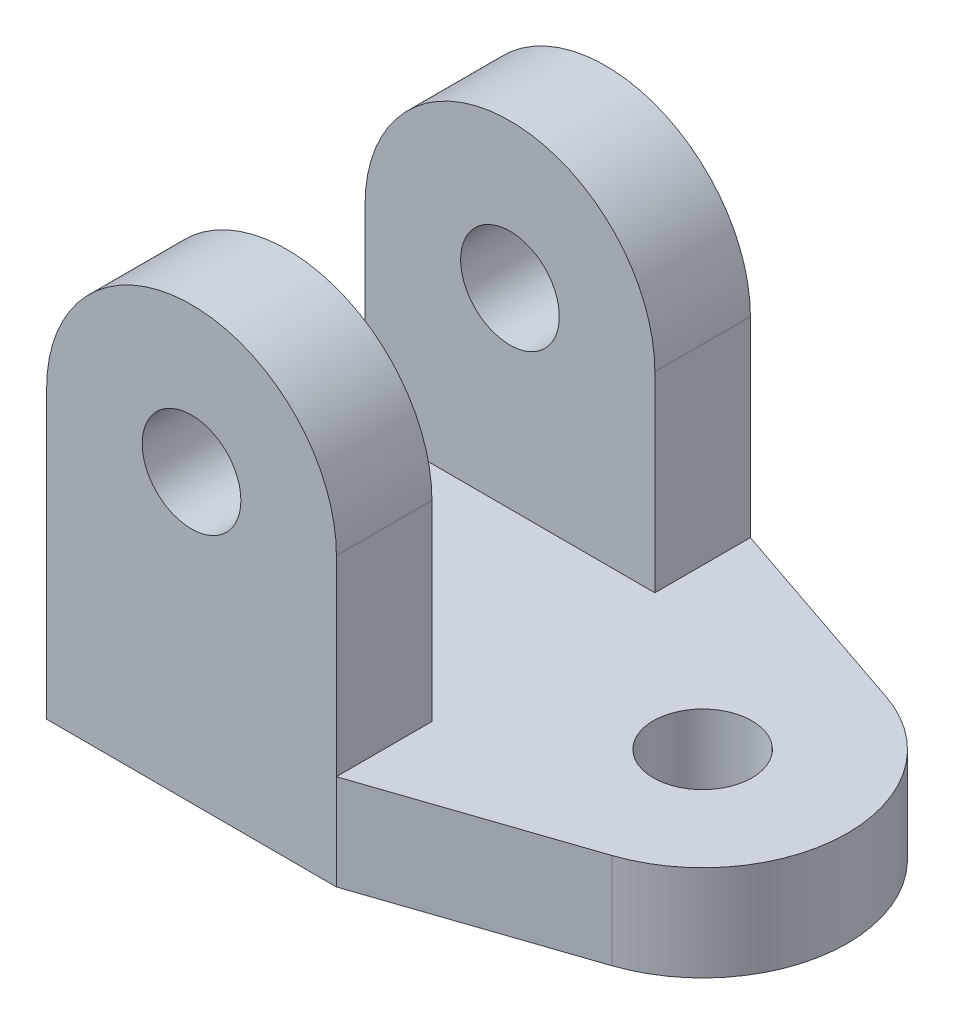
ISO-10303-21;
HEADER;
FILE_DESCRIPTION(('STEP AP214'),'2;1');
FILE_NAME('part.step','',(''),(''),'','','');
FILE_SCHEMA(('AUTOMOTIVE_DESIGN { 1 0 10303 214 1 1 1 1 }'));
ENDSEC;
DATA;
#1=APPLICATION_CONTEXT('core data for automotive mechanical design processes');
#2=APPLICATION_PROTOCOL_DEFINITION('international standard','automotive_design',2000,#1);
#3=PRODUCT_CONTEXT('',#1,'mechanical');
#4=PRODUCT('Part','Part','',(#3));
#5=PRODUCT_RELATED_PRODUCT_CATEGORY('part','',(#4));
#6=PRODUCT_DEFINITION_FORMATION('','',#4);
#7=PRODUCT_DEFINITION_CONTEXT('part definition',#1,'design');
#8=PRODUCT_DEFINITION('design','',#6,#7);
#9=PRODUCT_DEFINITION_SHAPE('','',#8);
#10=(LENGTH_UNIT() NAMED_UNIT(*) SI_UNIT(.MILLI.,.METRE.));
#11=(NAMED_UNIT(*) PLANE_ANGLE_UNIT() SI_UNIT($,.RADIAN.));
#12=(NAMED_UNIT(*) SI_UNIT($,.STERADIAN.) SOLID_ANGLE_UNIT());
#13=UNCERTAINTY_MEASURE_WITH_UNIT(LENGTH_MEASURE(1.E-05),#10,'distance_accuracy_value','');
#14=(GEOMETRIC_REPRESENTATION_CONTEXT(3) GLOBAL_UNCERTAINTY_ASSIGNED_CONTEXT((#13)) GLOBAL_UNIT_ASSIGNED_CONTEXT((#10,
#11,#12)) REPRESENTATION_CONTEXT('',''));
#15=CARTESIAN_POINT('',(0.,0.,0.));
#16=DIRECTION('',(0.,0.,1.));
#17=DIRECTION('',(1.,0.,0.));
#18=AXIS2_PLACEMENT_3D('',#15,#16,#17);
#19=CARTESIAN_POINT('',(-0.0141145084440973,-10.8957658007297,0.));
#20=DIRECTION('',(-0.00129541115874928,-0.999999160954613,0.));
#21=DIRECTION('',(0.999999160954613,-0.00129541115874928,0.));
#22=AXIS2_PLACEMENT_3D('',#19,#20,#21);
#23=PLANE('',#22);
#24=CARTESIAN_POINT('',(94.5499958047985,-11.0182653072293,-3.5));
#25=DIRECTION('',(-0.00129541115874928,-0.999999160954613,0.));
#26=DIRECTION('',(0.999999160954613,-0.00129541115874928,0.));
#27=AXIS2_PLACEMENT_3D('',#24,#25,#26);
#28=CIRCLE('',#27,1.54999999999999);
#29=CARTESIAN_POINT('',(96.0999945042781,-11.0202731945254,-3.5));
#30=VERTEX_POINT('',#29);
#31=EDGE_CURVE('E164',#30,#30,#28,.T.);
#32=ORIENTED_EDGE('',*,*,#31,.T.);
#33=EDGE_LOOP('',(#32));
#34=FACE_BOUND('',#33,.T.);
#35=DIRECTION('',(-0.999999160954613,0.00129541115874926,0.));
#36=VECTOR('',#35,1.);
#37=CARTESIAN_POINT('',(89.5500000000254,-11.0117882514356,-7.));
#38=LINE('',#37,#36);
#39=CARTESIAN_POINT('',(89.5500000000254,-11.0117882514356,-7.));
#40=VERTEX_POINT('',#39);
#41=CARTESIAN_POINT('',(80.4499999999746,-11.,-7.));
#42=VERTEX_POINT('',#41);
#43=EDGE_CURVE('E57',#40,#42,#38,.T.);
#44=ORIENTED_EDGE('',*,*,#43,.T.);
#45=DIRECTION('',(0.,0.,-1.));
#46=VECTOR('',#45,1.);
#47=CARTESIAN_POINT('',(80.4499999999746,-11.,0.));
#48=LINE('',#47,#46);
#49=CARTESIAN_POINT('',(80.4499999999746,-11.,0.));
#50=VERTEX_POINT('',#49);
#51=EDGE_CURVE('E183',#50,#42,#48,.T.);
#52=ORIENTED_EDGE('',*,*,#51,.F.);
#53=DIRECTION('',(-0.999999160954613,0.00129541115874926,0.));
#54=VECTOR('',#53,1.);
#55=CARTESIAN_POINT('',(-0.014114508444097,-10.8957658007297,0.));
#56=LINE('',#55,#54);
#57=CARTESIAN_POINT('',(89.5500000000254,-11.0117882514356,0.));
#58=VERTEX_POINT('',#57);
#59=EDGE_CURVE('E38',#58,#50,#56,.T.);
#60=ORIENTED_EDGE('',*,*,#59,.F.);
#61=DIRECTION('',(0.,0.,-1.));
#62=VECTOR('',#61,1.);
#63=CARTESIAN_POINT('',(89.5500000000254,-11.0117882514356,3.));
#64=LINE('',#63,#62);
#65=CARTESIAN_POINT('',(89.5500000000254,-11.0117882514356,3.));
#66=VERTEX_POINT('',#65);
#67=EDGE_CURVE('E11',#66,#58,#64,.T.);
#68=ORIENTED_EDGE('',*,*,#67,.F.);
#69=DIRECTION('',(0.947030642459823,-0.00122679509125672,-0.321140868180835));
#70=VECTOR('',#69,1.);
#71=CARTESIAN_POINT('',(10.1351538632099,-10.9089132872628,29.9298072220575));
#72=LINE('',#71,#70);
#73=CARTESIAN_POINT('',(96.0111855290157,-11.0201581502913,0.808993038632917));
#74=VERTEX_POINT('',#73);
#75=EDGE_CURVE('E180',#66,#74,#72,.T.);
#76=ORIENTED_EDGE('',*,*,#75,.T.);
#77=CARTESIAN_POINT('',(94.5499958047985,-11.0182653072293,-3.5));
#78=DIRECTION('',(-0.00129541115874928,-0.999999160954613,0.));
#79=DIRECTION('',(0.999999160954613,-0.00129541115874928,0.));
#80=AXIS2_PLACEMENT_3D('',#77,#78,#79);
#81=CIRCLE('',#80,4.54999999999999);
#82=CARTESIAN_POINT('',(96.0111855290157,-11.0201581502913,-7.80899303863292));
#83=VERTEX_POINT('',#82);
#84=EDGE_CURVE('E155',#83,#74,#81,.T.);
#85=ORIENTED_EDGE('',*,*,#84,.F.);
#86=DIRECTION('',(0.947030642459822,-0.00122679509125672,0.321140868180836));
#87=VECTOR('',#86,1.);
#88=CARTESIAN_POINT('',(12.2640655622038,-10.9116711055476,-36.2078870215461));
#89=LINE('',#88,#87);
#90=CARTESIAN_POINT('',(89.5500000000254,-11.0117882514356,-10.));
#91=VERTEX_POINT('',#90);
#92=EDGE_CURVE('E153',#91,#83,#89,.T.);
#93=ORIENTED_EDGE('',*,*,#92,.F.);
#94=DIRECTION('',(0.,0.,1.));
#95=VECTOR('',#94,1.);
#96=CARTESIAN_POINT('',(89.5500000000254,-11.0117882514356,-10.));
#97=LINE('',#96,#95);
#98=EDGE_CURVE('E52',#91,#40,#97,.T.);
#99=ORIENTED_EDGE('',*,*,#98,.T.);
#100=EDGE_LOOP('',(#44,#52,#60,#68,#76,#85,#93,#99));
#101=FACE_BOUND('',#100,.T.);
#102=ADVANCED_FACE('F34',(#34,#101),#23,.F.);
#103=CARTESIAN_POINT('',(89.5500000000254,0.,3.));
#104=DIRECTION('',(1.,0.,0.));
#105=DIRECTION('',(0.,0.,-1.));
#106=AXIS2_PLACEMENT_3D('',#103,#104,#105);
#107=PLANE('',#106);
#108=DIRECTION('',(0.,-1.,0.));
#109=VECTOR('',#108,1.);
#110=CARTESIAN_POINT('',(89.5500000000254,0.,0.));
#111=LINE('',#110,#109);
#112=CARTESIAN_POINT('',(89.550000000009,-5.,0.));
#113=VERTEX_POINT('',#112);
#114=EDGE_CURVE('E206',#113,#58,#111,.T.);
#115=ORIENTED_EDGE('',*,*,#114,.F.);
#116=DIRECTION('',(0.,0.,-1.));
#117=VECTOR('',#116,1.);
#118=CARTESIAN_POINT('',(89.550000000009,-5.,3.));
#119=LINE('',#118,#117);
#120=CARTESIAN_POINT('',(89.550000000009,-5.,3.));
#121=VERTEX_POINT('',#120);
#122=EDGE_CURVE('E44',#121,#113,#119,.T.);
#123=ORIENTED_EDGE('',*,*,#122,.F.);
#124=DIRECTION('',(0.,-1.,0.));
#125=VECTOR('',#124,1.);
#126=CARTESIAN_POINT('',(89.5500000000254,0.,3.));
#127=LINE('',#126,#125);
#128=EDGE_CURVE('E192',#121,#66,#127,.T.);
#129=ORIENTED_EDGE('',*,*,#128,.T.);
#130=ORIENTED_EDGE('',*,*,#67,.T.);
#131=EDGE_LOOP('',(#115,#123,#129,#130));
#132=FACE_BOUND('',#131,.T.);
#133=ADVANCED_FACE('F36',(#132),#107,.T.);
#134=CARTESIAN_POINT('',(85.,-5.,3.));
#135=DIRECTION('',(0.,0.,-1.));
#136=DIRECTION('',(-1.,0.,0.));
#137=AXIS2_PLACEMENT_3D('',#134,#135,#136);
#138=CYLINDRICAL_SURFACE('',#137,4.5499999999926);
#139=CARTESIAN_POINT('',(85.,-5.,0.));
#140=DIRECTION('',(0.,0.,1.));
#141=DIRECTION('',(1.,0.,0.));
#142=AXIS2_PLACEMENT_3D('',#139,#140,#141);
#143=CIRCLE('',#142,4.5499999999926);
#144=CARTESIAN_POINT('',(80.449999999991,-5.00000000000001,0.));
#145=VERTEX_POINT('',#144);
#146=EDGE_CURVE('E209',#113,#145,#143,.T.);
#147=ORIENTED_EDGE('',*,*,#146,.T.);
#148=DIRECTION('',(0.,0.,-1.));
#149=VECTOR('',#148,1.);
#150=CARTESIAN_POINT('',(80.449999999991,-5.00000000000001,3.));
#151=LINE('',#150,#149);
#152=CARTESIAN_POINT('',(80.449999999991,-5.00000000000001,3.));
#153=VERTEX_POINT('',#152);
#154=EDGE_CURVE('E214',#153,#145,#151,.T.);
#155=ORIENTED_EDGE('',*,*,#154,.F.);
#156=CARTESIAN_POINT('',(85.,-5.,3.));
#157=DIRECTION('',(0.,0.,1.));
#158=DIRECTION('',(1.,0.,0.));
#159=AXIS2_PLACEMENT_3D('',#156,#157,#158);
#160=CIRCLE('',#159,4.5499999999926);
#161=EDGE_CURVE('E195',#121,#153,#160,.T.);
#162=ORIENTED_EDGE('',*,*,#161,.F.);
#163=ORIENTED_EDGE('',*,*,#122,.T.);
#164=EDGE_LOOP('',(#147,#155,#162,#163));
#165=FACE_BOUND('',#164,.T.);
#166=ADVANCED_FACE('F262',(#165),#138,.T.);
#167=CARTESIAN_POINT('',(80.4499999999746,0.,3.));
#168=DIRECTION('',(1.,0.,0.));
#169=DIRECTION('',(0.,0.,-1.));
#170=AXIS2_PLACEMENT_3D('',#167,#168,#169);
#171=PLANE('',#170);
#172=DIRECTION('',(0.,-1.,0.));
#173=VECTOR('',#172,1.);
#174=CARTESIAN_POINT('',(80.4499999999746,0.,0.));
#175=LINE('',#174,#173);
#176=EDGE_CURVE('E211',#145,#50,#175,.T.);
#177=ORIENTED_EDGE('',*,*,#176,.T.);
#178=DIRECTION('',(0.,0.,-1.));
#179=VECTOR('',#178,1.);
#180=CARTESIAN_POINT('',(80.4499999999746,-11.,3.));
#181=LINE('',#180,#179);
#182=CARTESIAN_POINT('',(80.4499999999746,-11.,3.));
#183=VERTEX_POINT('',#182);
#184=EDGE_CURVE('E203',#183,#50,#181,.T.);
#185=ORIENTED_EDGE('',*,*,#184,.F.);
#186=DIRECTION('',(0.,-1.,0.));
#187=VECTOR('',#186,1.);
#188=CARTESIAN_POINT('',(80.4499999999746,0.,3.));
#189=LINE('',#188,#187);
#190=EDGE_CURVE('E198',#153,#183,#189,.T.);
#191=ORIENTED_EDGE('',*,*,#190,.F.);
#192=ORIENTED_EDGE('',*,*,#154,.T.);
#193=EDGE_LOOP('',(#177,#185,#191,#192));
#194=FACE_BOUND('',#193,.T.);
#195=ADVANCED_FACE('F228',(#194),#171,.F.);
#196=CARTESIAN_POINT('',(85.,-5.,3.));
#197=DIRECTION('',(0.,0.,-1.));
#198=DIRECTION('',(-1.,0.,0.));
#199=AXIS2_PLACEMENT_3D('',#196,#197,#198);
#200=CYLINDRICAL_SURFACE('',#199,1.54999999999259);
#201=CARTESIAN_POINT('',(85.,-5.,3.));
#202=DIRECTION('',(0.,0.,1.));
#203=DIRECTION('',(1.,0.,0.));
#204=AXIS2_PLACEMENT_3D('',#201,#202,#203);
#205=CIRCLE('',#204,1.54999999999259);
#206=CARTESIAN_POINT('',(86.5499999999926,-5.,3.));
#207=VERTEX_POINT('',#206);
#208=EDGE_CURVE('E201',#207,#207,#205,.T.);
#209=ORIENTED_EDGE('',*,*,#208,.T.);
#210=EDGE_LOOP('',(#209));
#211=FACE_BOUND('',#210,.T.);
#212=CARTESIAN_POINT('',(85.,-5.,0.));
#213=DIRECTION('',(0.,0.,1.));
#214=DIRECTION('',(1.,0.,0.));
#215=AXIS2_PLACEMENT_3D('',#212,#213,#214);
#216=CIRCLE('',#215,1.54999999999259);
#217=CARTESIAN_POINT('',(86.5499999999926,-5.,0.));
#218=VERTEX_POINT('',#217);
#219=EDGE_CURVE('E196',#218,#218,#216,.T.);
#220=ORIENTED_EDGE('',*,*,#219,.F.);
#221=EDGE_LOOP('',(#220));
#222=FACE_BOUND('',#221,.T.);
#223=ADVANCED_FACE('F412',(#211,#222),#200,.F.);
#224=CARTESIAN_POINT('',(0.,0.,3.));
#225=DIRECTION('',(0.,0.,1.));
#226=DIRECTION('',(1.,0.,0.));
#227=AXIS2_PLACEMENT_3D('',#224,#225,#226);
#228=PLANE('',#227);
#229=ORIENTED_EDGE('',*,*,#190,.T.);
#230=DIRECTION('',(0.00129541115874926,0.999999160954613,0.));
#231=VECTOR('',#230,1.);
#232=CARTESIAN_POINT('',(80.4461137664984,-13.9999974828638,3.));
#233=LINE('',#232,#231);
#234=CARTESIAN_POINT('',(80.4461137664984,-13.9999974828638,3.));
#235=VERTEX_POINT('',#234);
#236=EDGE_CURVE('E250',#235,#183,#233,.T.);
#237=ORIENTED_EDGE('',*,*,#236,.F.);
#238=DIRECTION('',(-0.999999160954613,0.00129541115874928,0.));
#239=VECTOR('',#238,1.);
#240=CARTESIAN_POINT('',(-0.0180007419203451,-13.8957632835935,3.));
#241=LINE('',#240,#239);
#242=CARTESIAN_POINT('',(89.5461137665491,-14.0117857342994,3.));
#243=VERTEX_POINT('',#242);
#244=EDGE_CURVE('E171',#243,#235,#241,.T.);
#245=ORIENTED_EDGE('',*,*,#244,.F.);
#246=DIRECTION('',(0.00129541115874926,0.999999160954613,0.));
#247=VECTOR('',#246,1.);
#248=CARTESIAN_POINT('',(89.5461137665491,-14.0117857342994,3.));
#249=LINE('',#248,#247);
#250=EDGE_CURVE('E245',#243,#66,#249,.T.);
#251=ORIENTED_EDGE('',*,*,#250,.T.);
#252=ORIENTED_EDGE('',*,*,#128,.F.);
#253=ORIENTED_EDGE('',*,*,#161,.T.);
#254=EDGE_LOOP('',(#229,#237,#245,#251,#252,#253));
#255=FACE_BOUND('',#254,.T.);
#256=ORIENTED_EDGE('',*,*,#208,.F.);
#257=EDGE_LOOP('',(#256));
#258=FACE_BOUND('',#257,.T.);
#259=ADVANCED_FACE('F257',(#255,#258),#228,.T.);
#260=CARTESIAN_POINT('',(0.,0.,0.));
#261=DIRECTION('',(0.,0.,1.));
#262=DIRECTION('',(1.,0.,0.));
#263=AXIS2_PLACEMENT_3D('',#260,#261,#262);
#264=PLANE('',#263);
#265=ORIENTED_EDGE('',*,*,#59,.T.);
#266=ORIENTED_EDGE('',*,*,#176,.F.);
#267=ORIENTED_EDGE('',*,*,#146,.F.);
#268=ORIENTED_EDGE('',*,*,#114,.T.);
#269=EDGE_LOOP('',(#265,#266,#267,#268));
#270=FACE_BOUND('',#269,.T.);
#271=ORIENTED_EDGE('',*,*,#219,.T.);
#272=EDGE_LOOP('',(#271));
#273=FACE_BOUND('',#272,.T.);
#274=ADVANCED_FACE('F233',(#270,#273),#264,.F.);
#275=CARTESIAN_POINT('',(-0.0180007419203451,-13.8957632835935,-10.));
#276=DIRECTION('',(0.,0.,1.));
#277=DIRECTION('',(1.,0.,0.));
#278=AXIS2_PLACEMENT_3D('',#275,#276,#277);
#279=PLANE('',#278);
#280=DIRECTION('',(0.00129541115874926,0.999999160954613,0.));
#281=VECTOR('',#280,1.);
#282=CARTESIAN_POINT('',(80.4461137664984,-13.9999974828638,-10.));
#283=LINE('',#282,#281);
#284=CARTESIAN_POINT('',(80.4461137664984,-13.9999974828638,-10.));
#285=VERTEX_POINT('',#284);
#286=CARTESIAN_POINT('',(80.4499999999746,-11.,-10.));
#287=VERTEX_POINT('',#286);
#288=EDGE_CURVE('E146',#285,#287,#283,.T.);
#289=ORIENTED_EDGE('',*,*,#288,.T.);
#290=DIRECTION('',(2.73161123350481E-12,1.,0.));
#291=VECTOR('',#290,1.);
#292=CARTESIAN_POINT('',(80.4499999999746,-11.,-10.));
#293=LINE('',#292,#291);
#294=CARTESIAN_POINT('',(80.449999999991,-5.,-10.));
#295=VERTEX_POINT('',#294);
#296=EDGE_CURVE('E138',#287,#295,#293,.T.);
#297=ORIENTED_EDGE('',*,*,#296,.T.);
#298=CARTESIAN_POINT('',(85.,-5.,-10.));
#299=DIRECTION('',(0.,0.,-1.));
#300=DIRECTION('',(-1.,0.,0.));
#301=AXIS2_PLACEMENT_3D('',#298,#299,#300);
#302=CIRCLE('',#301,4.55000000000899);
#303=CARTESIAN_POINT('',(89.550000000009,-5.,-10.));
#304=VERTEX_POINT('',#303);
#305=EDGE_CURVE('E126',#295,#304,#302,.T.);
#306=ORIENTED_EDGE('',*,*,#305,.T.);
#307=DIRECTION('',(2.7262549370589E-12,-1.,0.));
#308=VECTOR('',#307,1.);
#309=CARTESIAN_POINT('',(89.550000000009,-5.,-10.));
#310=LINE('',#309,#308);
#311=EDGE_CURVE('E137',#304,#91,#310,.T.);
#312=ORIENTED_EDGE('',*,*,#311,.T.);
#313=DIRECTION('',(0.00129541115874926,0.999999160954613,0.));
#314=VECTOR('',#313,1.);
#315=CARTESIAN_POINT('',(89.5461137665491,-14.0117857342994,-10.));
#316=LINE('',#315,#314);
#317=CARTESIAN_POINT('',(89.5461137665491,-14.0117857342994,-10.));
#318=VERTEX_POINT('',#317);
#319=EDGE_CURVE('E190',#318,#91,#316,.T.);
#320=ORIENTED_EDGE('',*,*,#319,.F.);
#321=DIRECTION('',(0.999999160954613,-0.00129541115874928,0.));
#322=VECTOR('',#321,1.);
#323=CARTESIAN_POINT('',(-0.0180007419203451,-13.8957632835935,-10.));
#324=LINE('',#323,#322);
#325=EDGE_CURVE('E160',#285,#318,#324,.T.);
#326=ORIENTED_EDGE('',*,*,#325,.F.);
#327=EDGE_LOOP('',(#289,#297,#306,#312,#320,#326));
#328=FACE_BOUND('',#327,.T.);
#329=CARTESIAN_POINT('',(85.,-5.,-10.));
#330=DIRECTION('',(0.,0.,-1.));
#331=DIRECTION('',(-1.,0.,0.));
#332=AXIS2_PLACEMENT_3D('',#329,#330,#331);
#333=CIRCLE('',#332,1.55000000000001);
#334=CARTESIAN_POINT('',(83.45,-5.,-10.));
#335=VERTEX_POINT('',#334);
#336=EDGE_CURVE('E282',#335,#335,#333,.T.);
#337=ORIENTED_EDGE('',*,*,#336,.F.);
#338=EDGE_LOOP('',(#337));
#339=FACE_BOUND('',#338,.T.);
#340=ADVANCED_FACE('F142',(#328,#339),#279,.F.);
#341=CARTESIAN_POINT('',(12.2601793287276,-13.9116685884115,-36.2078870215461));
#342=DIRECTION('',(-0.321140598729072,0.000416009464171881,0.94703143706218));
#343=DIRECTION('',(0.947031519010656,0.,0.321140626517994));
#344=AXIS2_PLACEMENT_3D('',#341,#342,#343);
#345=PLANE('',#344);
#346=ORIENTED_EDGE('',*,*,#92,.T.);
#347=DIRECTION('',(0.00129541115874926,0.999999160954613,0.));
#348=VECTOR('',#347,1.);
#349=CARTESIAN_POINT('',(96.0072992955395,-14.0201556331551,-7.80899303863292));
#350=LINE('',#349,#348);
#351=CARTESIAN_POINT('',(96.0072992955395,-14.0201556331551,-7.80899303863292));
#352=VERTEX_POINT('',#351);
#353=EDGE_CURVE('E236',#352,#83,#350,.T.);
#354=ORIENTED_EDGE('',*,*,#353,.F.);
#355=DIRECTION('',(0.947030642459822,-0.00122679509125672,0.321140868180836));
#356=VECTOR('',#355,1.);
#357=CARTESIAN_POINT('',(12.2601793287276,-13.9116685884115,-36.2078870215461));
#358=LINE('',#357,#356);
#359=EDGE_CURVE('E163',#318,#352,#358,.T.);
#360=ORIENTED_EDGE('',*,*,#359,.F.);
#361=ORIENTED_EDGE('',*,*,#319,.T.);
#362=EDGE_LOOP('',(#346,#354,#360,#361));
#363=FACE_BOUND('',#362,.T.);
#364=ADVANCED_FACE('F293',(#363),#345,.F.);
#365=CARTESIAN_POINT('',(94.5461095713222,-14.0182627900932,-3.5));
#366=DIRECTION('',(0.00129541115874926,0.999999160954613,0.));
#367=DIRECTION('',(-0.999999160954613,0.00129541115874926,0.));
#368=AXIS2_PLACEMENT_3D('',#365,#366,#367);
#369=CYLINDRICAL_SURFACE('',#368,4.54999999999999);
#370=ORIENTED_EDGE('',*,*,#84,.T.);
#371=DIRECTION('',(0.00129541115874926,0.999999160954613,0.));
#372=VECTOR('',#371,1.);
#373=CARTESIAN_POINT('',(96.0072992955395,-14.0201556331551,0.808993038632917));
#374=LINE('',#373,#372);
#375=CARTESIAN_POINT('',(96.0072992955395,-14.0201556331551,0.808993038632917));
#376=VERTEX_POINT('',#375);
#377=EDGE_CURVE('E240',#376,#74,#374,.T.);
#378=ORIENTED_EDGE('',*,*,#377,.F.);
#379=CARTESIAN_POINT('',(94.5461095713222,-14.0182627900932,-3.5));
#380=DIRECTION('',(-0.00129541115874928,-0.999999160954613,0.));
#381=DIRECTION('',(0.999999160954613,-0.00129541115874928,0.));
#382=AXIS2_PLACEMENT_3D('',#379,#380,#381);
#383=CIRCLE('',#382,4.54999999999999);
#384=EDGE_CURVE('E166',#352,#376,#383,.T.);
#385=ORIENTED_EDGE('',*,*,#384,.F.);
#386=ORIENTED_EDGE('',*,*,#353,.T.);
#387=EDGE_LOOP('',(#370,#378,#385,#386));
#388=FACE_BOUND('',#387,.T.);
#389=ADVANCED_FACE('F269',(#388),#369,.T.);
#390=CARTESIAN_POINT('',(10.1312676297336,-13.9089107701267,29.9298072220575));
#391=DIRECTION('',(0.32114059872907,-0.000416009464171879,0.947031437062181));
#392=DIRECTION('',(0.947031519010657,0.,-0.321140626517992));
#393=AXIS2_PLACEMENT_3D('',#390,#391,#392);
#394=PLANE('',#393);
#395=ORIENTED_EDGE('',*,*,#75,.F.);
#396=ORIENTED_EDGE('',*,*,#250,.F.);
#397=DIRECTION('',(0.947030642459823,-0.00122679509125672,-0.321140868180835));
#398=VECTOR('',#397,1.);
#399=CARTESIAN_POINT('',(10.1312676297336,-13.9089107701267,29.9298072220575));
#400=LINE('',#399,#398);
#401=EDGE_CURVE('E168',#243,#376,#400,.T.);
#402=ORIENTED_EDGE('',*,*,#401,.T.);
#403=ORIENTED_EDGE('',*,*,#377,.T.);
#404=EDGE_LOOP('',(#395,#396,#402,#403));
#405=FACE_BOUND('',#404,.T.);
#406=ADVANCED_FACE('F267',(#405),#394,.T.);
#407=CARTESIAN_POINT('',(80.4461137664984,-13.9999974828638,0.));
#408=DIRECTION('',(0.999999160954613,-0.00129541115874926,0.));
#409=DIRECTION('',(0.00129541115874926,0.999999160954613,0.));
#410=AXIS2_PLACEMENT_3D('',#407,#408,#409);
#411=PLANE('',#410);
#412=ORIENTED_EDGE('',*,*,#184,.T.);
#413=ORIENTED_EDGE('',*,*,#51,.T.);
#414=DIRECTION('',(0.,0.,1.));
#415=VECTOR('',#414,1.);
#416=CARTESIAN_POINT('',(80.4499999999746,-11.,-10.));
#417=LINE('',#416,#415);
#418=EDGE_CURVE('E271',#287,#42,#417,.T.);
#419=ORIENTED_EDGE('',*,*,#418,.F.);
#420=ORIENTED_EDGE('',*,*,#288,.F.);
#421=DIRECTION('',(0.,0.,-1.));
#422=VECTOR('',#421,1.);
#423=CARTESIAN_POINT('',(80.4461137664984,-13.9999974828638,0.));
#424=LINE('',#423,#422);
#425=EDGE_CURVE('E173',#235,#285,#424,.T.);
#426=ORIENTED_EDGE('',*,*,#425,.F.);
#427=ORIENTED_EDGE('',*,*,#236,.T.);
#428=EDGE_LOOP('',(#412,#413,#419,#420,#426,#427));
#429=FACE_BOUND('',#428,.T.);
#430=ADVANCED_FACE('F254',(#429),#411,.F.);
#431=CARTESIAN_POINT('',(94.5461095713222,-14.0182627900932,-3.5));
#432=DIRECTION('',(0.00129541115874926,0.999999160954613,0.));
#433=DIRECTION('',(-0.999999160954613,0.00129541115874926,0.));
#434=AXIS2_PLACEMENT_3D('',#431,#432,#433);
#435=CYLINDRICAL_SURFACE('',#434,1.54999999999999);
#436=CARTESIAN_POINT('',(94.5461095713222,-14.0182627900932,-3.5));
#437=DIRECTION('',(-0.00129541115874928,-0.999999160954613,0.));
#438=DIRECTION('',(0.999999160954613,-0.00129541115874928,0.));
#439=AXIS2_PLACEMENT_3D('',#436,#437,#438);
#440=CIRCLE('',#439,1.54999999999999);
#441=CARTESIAN_POINT('',(96.0961082708018,-14.0202706773892,-3.5));
#442=VERTEX_POINT('',#441);
#443=EDGE_CURVE('E175',#442,#442,#440,.T.);
#444=ORIENTED_EDGE('',*,*,#443,.T.);
#445=EDGE_LOOP('',(#444));
#446=FACE_BOUND('',#445,.T.);
#447=ORIENTED_EDGE('',*,*,#31,.F.);
#448=EDGE_LOOP('',(#447));
#449=FACE_BOUND('',#448,.T.);
#450=ADVANCED_FACE('F313',(#446,#449),#435,.F.);
#451=CARTESIAN_POINT('',(-0.0180007419203451,-13.8957632835935,0.));
#452=DIRECTION('',(-0.00129541115874928,-0.999999160954613,0.));
#453=DIRECTION('',(0.999999160954613,-0.00129541115874928,0.));
#454=AXIS2_PLACEMENT_3D('',#451,#452,#453);
#455=PLANE('',#454);
#456=ORIENTED_EDGE('',*,*,#325,.T.);
#457=ORIENTED_EDGE('',*,*,#359,.T.);
#458=ORIENTED_EDGE('',*,*,#384,.T.);
#459=ORIENTED_EDGE('',*,*,#401,.F.);
#460=ORIENTED_EDGE('',*,*,#244,.T.);
#461=ORIENTED_EDGE('',*,*,#425,.T.);
#462=EDGE_LOOP('',(#456,#457,#458,#459,#460,#461));
#463=FACE_BOUND('',#462,.T.);
#464=ORIENTED_EDGE('',*,*,#443,.F.);
#465=EDGE_LOOP('',(#464));
#466=FACE_BOUND('',#465,.T.);
#467=ADVANCED_FACE('F311',(#463,#466),#455,.T.);
#468=CARTESIAN_POINT('',(85.,-5.,-7.));
#469=DIRECTION('',(0.,0.,-1.));
#470=DIRECTION('',(-1.,0.,0.));
#471=AXIS2_PLACEMENT_3D('',#468,#469,#470);
#472=PLANE('',#471);
#473=DIRECTION('',(2.73161123350481E-12,1.,0.));
#474=VECTOR('',#473,1.);
#475=CARTESIAN_POINT('',(80.4499999999746,-11.,-7.));
#476=LINE('',#475,#474);
#477=CARTESIAN_POINT('',(80.449999999991,-5.,-7.));
#478=VERTEX_POINT('',#477);
#479=EDGE_CURVE('E152',#42,#478,#476,.T.);
#480=ORIENTED_EDGE('',*,*,#479,.F.);
#481=ORIENTED_EDGE('',*,*,#43,.F.);
#482=DIRECTION('',(2.7262549370589E-12,-1.,0.));
#483=VECTOR('',#482,1.);
#484=CARTESIAN_POINT('',(89.550000000009,-5.,-7.));
#485=LINE('',#484,#483);
#486=CARTESIAN_POINT('',(89.550000000009,-5.,-7.));
#487=VERTEX_POINT('',#486);
#488=EDGE_CURVE('E275',#487,#40,#485,.T.);
#489=ORIENTED_EDGE('',*,*,#488,.F.);
#490=CARTESIAN_POINT('',(85.,-5.,-7.));
#491=DIRECTION('',(0.,0.,-1.));
#492=DIRECTION('',(-1.,0.,0.));
#493=AXIS2_PLACEMENT_3D('',#490,#491,#492);
#494=CIRCLE('',#493,4.55000000000899);
#495=EDGE_CURVE('E280',#478,#487,#494,.T.);
#496=ORIENTED_EDGE('',*,*,#495,.F.);
#497=EDGE_LOOP('',(#480,#481,#489,#496));
#498=FACE_BOUND('',#497,.T.);
#499=CARTESIAN_POINT('',(85.,-5.,-7.));
#500=DIRECTION('',(0.,0.,-1.));
#501=DIRECTION('',(-1.,0.,0.));
#502=AXIS2_PLACEMENT_3D('',#499,#500,#501);
#503=CIRCLE('',#502,1.55000000000001);
#504=CARTESIAN_POINT('',(83.45,-5.,-7.));
#505=VERTEX_POINT('',#504);
#506=EDGE_CURVE('E284',#505,#505,#503,.T.);
#507=ORIENTED_EDGE('',*,*,#506,.T.);
#508=EDGE_LOOP('',(#507));
#509=FACE_BOUND('',#508,.T.);
#510=ADVANCED_FACE('F344',(#498,#509),#472,.F.);
#511=CARTESIAN_POINT('',(80.4499999999746,-11.,-10.));
#512=DIRECTION('',(1.,-2.73161123350481E-12,0.));
#513=DIRECTION('',(2.73161123350481E-12,1.,0.));
#514=AXIS2_PLACEMENT_3D('',#511,#512,#513);
#515=PLANE('',#514);
#516=ORIENTED_EDGE('',*,*,#479,.T.);
#517=DIRECTION('',(0.,0.,1.));
#518=VECTOR('',#517,1.);
#519=CARTESIAN_POINT('',(80.449999999991,-5.,-10.));
#520=LINE('',#519,#518);
#521=EDGE_CURVE('E130',#295,#478,#520,.T.);
#522=ORIENTED_EDGE('',*,*,#521,.F.);
#523=ORIENTED_EDGE('',*,*,#296,.F.);
#524=ORIENTED_EDGE('',*,*,#418,.T.);
#525=EDGE_LOOP('',(#516,#522,#523,#524));
#526=FACE_BOUND('',#525,.T.);
#527=ADVANCED_FACE('F150',(#526),#515,.F.);
#528=CARTESIAN_POINT('',(85.,-5.,-10.));
#529=DIRECTION('',(0.,0.,1.));
#530=DIRECTION('',(1.,0.,0.));
#531=AXIS2_PLACEMENT_3D('',#528,#529,#530);
#532=CYLINDRICAL_SURFACE('',#531,4.55000000000899);
#533=ORIENTED_EDGE('',*,*,#495,.T.);
#534=DIRECTION('',(0.,0.,1.));
#535=VECTOR('',#534,1.);
#536=CARTESIAN_POINT('',(89.550000000009,-5.,-10.));
#537=LINE('',#536,#535);
#538=EDGE_CURVE('E133',#304,#487,#537,.T.);
#539=ORIENTED_EDGE('',*,*,#538,.F.);
#540=ORIENTED_EDGE('',*,*,#305,.F.);
#541=ORIENTED_EDGE('',*,*,#521,.T.);
#542=EDGE_LOOP('',(#533,#539,#540,#541));
#543=FACE_BOUND('',#542,.T.);
#544=ADVANCED_FACE('F128',(#543),#532,.T.);
#545=CARTESIAN_POINT('',(89.550000000009,-5.,-10.));
#546=DIRECTION('',(-1.,-2.7262549370589E-12,0.));
#547=DIRECTION('',(2.7262549370589E-12,-1.,0.));
#548=AXIS2_PLACEMENT_3D('',#545,#546,#547);
#549=PLANE('',#548);
#550=ORIENTED_EDGE('',*,*,#488,.T.);
#551=ORIENTED_EDGE('',*,*,#98,.F.);
#552=ORIENTED_EDGE('',*,*,#311,.F.);
#553=ORIENTED_EDGE('',*,*,#538,.T.);
#554=EDGE_LOOP('',(#550,#551,#552,#553));
#555=FACE_BOUND('',#554,.T.);
#556=ADVANCED_FACE('F273',(#555),#549,.F.);
#557=CARTESIAN_POINT('',(85.,-5.,-10.));
#558=DIRECTION('',(0.,0.,1.));
#559=DIRECTION('',(1.,0.,0.));
#560=AXIS2_PLACEMENT_3D('',#557,#558,#559);
#561=CYLINDRICAL_SURFACE('',#560,1.55000000000001);
#562=ORIENTED_EDGE('',*,*,#336,.T.);
#563=EDGE_LOOP('',(#562));
#564=FACE_BOUND('',#563,.T.);
#565=ORIENTED_EDGE('',*,*,#506,.F.);
#566=EDGE_LOOP('',(#565));
#567=FACE_BOUND('',#566,.T.);
#568=ADVANCED_FACE('F290',(#564,#567),#561,.F.);
#569=CLOSED_SHELL('',(#102,#133,#166,#195,#223,#259,#274,#340,#364,#389,#406,#430,#450,#467,
#510,#527,#544,#556,#568));
#570=MANIFOLD_SOLID_BREP('B2',#569);
#571=ADVANCED_BREP_SHAPE_REPRESENTATION('',(#18,#570),#14);
#572=SHAPE_DEFINITION_REPRESENTATION(#9,#571);
ENDSEC;
END-ISO-10303-21;
